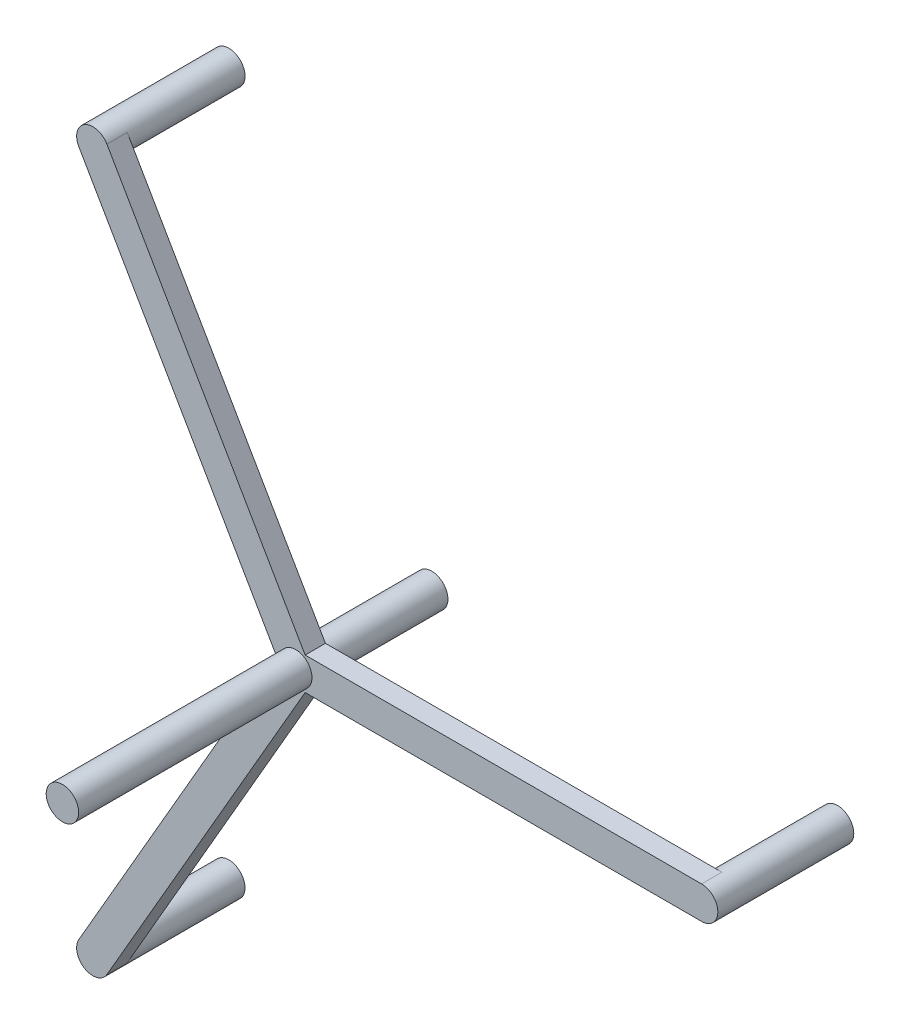
ISO-10303-21;
HEADER;
FILE_DESCRIPTION(('STEP AP214'),'2;1');
FILE_NAME('part.step','',(''),(''),'','','');
FILE_SCHEMA(('AUTOMOTIVE_DESIGN { 1 0 10303 214 1 1 1 1 }'));
ENDSEC;
DATA;
#1=APPLICATION_CONTEXT('core data for automotive mechanical design processes');
#2=APPLICATION_PROTOCOL_DEFINITION('international standard','automotive_design',2000,#1);
#3=PRODUCT_CONTEXT('',#1,'mechanical');
#4=PRODUCT('Part','Part','',(#3));
#5=PRODUCT_RELATED_PRODUCT_CATEGORY('part','',(#4));
#6=PRODUCT_DEFINITION_FORMATION('','',#4);
#7=PRODUCT_DEFINITION_CONTEXT('part definition',#1,'design');
#8=PRODUCT_DEFINITION('design','',#6,#7);
#9=PRODUCT_DEFINITION_SHAPE('','',#8);
#10=(LENGTH_UNIT() NAMED_UNIT(*) SI_UNIT(.MILLI.,.METRE.));
#11=(NAMED_UNIT(*) PLANE_ANGLE_UNIT() SI_UNIT($,.RADIAN.));
#12=(NAMED_UNIT(*) SI_UNIT($,.STERADIAN.) SOLID_ANGLE_UNIT());
#13=UNCERTAINTY_MEASURE_WITH_UNIT(LENGTH_MEASURE(1.E-05),#10,'distance_accuracy_value','');
#14=(GEOMETRIC_REPRESENTATION_CONTEXT(3) GLOBAL_UNCERTAINTY_ASSIGNED_CONTEXT((#13)) GLOBAL_UNIT_ASSIGNED_CONTEXT((#10,
#11,#12)) REPRESENTATION_CONTEXT('',''));
#15=CARTESIAN_POINT('',(0.,0.,0.));
#16=DIRECTION('',(0.,0.,1.));
#17=DIRECTION('',(1.,0.,0.));
#18=AXIS2_PLACEMENT_3D('',#15,#16,#17);
#19=CARTESIAN_POINT('',(0.,-2.,-1.25));
#20=DIRECTION('',(0.,-1.,0.));
#21=DIRECTION('',(0.,0.,-1.));
#22=AXIS2_PLACEMENT_3D('',#19,#20,#21);
#23=PLANE('',#22);
#24=DIRECTION('',(1.,0.,0.));
#25=VECTOR('',#24,1.);
#26=CARTESIAN_POINT('',(0.,-2.,1.25));
#27=LINE('',#26,#25);
#28=CARTESIAN_POINT('',(1.15470053837926,-2.,1.25));
#29=VERTEX_POINT('',#28);
#30=CARTESIAN_POINT('',(50.,-2.,1.25));
#31=VERTEX_POINT('',#30);
#32=EDGE_CURVE('E184',#29,#31,#27,.T.);
#33=ORIENTED_EDGE('',*,*,#32,.F.);
#34=DIRECTION('',(0.,0.,-1.));
#35=VECTOR('',#34,1.);
#36=CARTESIAN_POINT('',(1.15470053837926,-2.,-1.25));
#37=LINE('',#36,#35);
#38=CARTESIAN_POINT('',(1.15470053837926,-2.,-1.25));
#39=VERTEX_POINT('',#38);
#40=EDGE_CURVE('E50',#29,#39,#37,.T.);
#41=ORIENTED_EDGE('',*,*,#40,.T.);
#42=DIRECTION('',(1.,0.,0.));
#43=VECTOR('',#42,1.);
#44=CARTESIAN_POINT('',(0.,-2.,-1.25));
#45=LINE('',#44,#43);
#46=CARTESIAN_POINT('',(50.,-2.,-1.25));
#47=VERTEX_POINT('',#46);
#48=EDGE_CURVE('E191',#39,#47,#45,.T.);
#49=ORIENTED_EDGE('',*,*,#48,.T.);
#50=DIRECTION('',(0.,0.,1.));
#51=VECTOR('',#50,1.);
#52=CARTESIAN_POINT('',(50.,-2.,-1.25));
#53=LINE('',#52,#51);
#54=EDGE_CURVE('E197',#47,#31,#53,.T.);
#55=ORIENTED_EDGE('',*,*,#54,.T.);
#56=EDGE_LOOP('',(#33,#41,#49,#55));
#57=FACE_BOUND('',#56,.T.);
#58=ADVANCED_FACE('F36',(#57),#23,.T.);
#59=CARTESIAN_POINT('',(0.,0.,-15.5));
#60=DIRECTION('',(0.,0.,1.));
#61=DIRECTION('',(1.,0.,0.));
#62=AXIS2_PLACEMENT_3D('',#59,#60,#61);
#63=CYLINDRICAL_SURFACE('',#62,2.);
#64=CARTESIAN_POINT('',(0.,0.,-15.5));
#65=DIRECTION('',(0.,0.,1.));
#66=DIRECTION('',(1.,0.,0.));
#67=AXIS2_PLACEMENT_3D('',#64,#65,#66);
#68=CIRCLE('',#67,2.);
#69=CARTESIAN_POINT('',(2.,0.,-15.5));
#70=VERTEX_POINT('',#69);
#71=EDGE_CURVE('E175',#70,#70,#68,.T.);
#72=ORIENTED_EDGE('',*,*,#71,.T.);
#73=EDGE_LOOP('',(#72));
#74=FACE_BOUND('',#73,.T.);
#75=CARTESIAN_POINT('',(0.,0.,-1.25));
#76=DIRECTION('',(0.,0.,1.));
#77=DIRECTION('',(1.,0.,0.));
#78=AXIS2_PLACEMENT_3D('',#75,#76,#77);
#79=CIRCLE('',#78,2.);
#80=CARTESIAN_POINT('',(2.,0.,-1.25));
#81=VERTEX_POINT('',#80);
#82=EDGE_CURVE('E188',#81,#81,#79,.T.);
#83=ORIENTED_EDGE('',*,*,#82,.F.);
#84=EDGE_LOOP('',(#83));
#85=FACE_BOUND('',#84,.T.);
#86=ADVANCED_FACE('F235',(#74,#85),#63,.T.);
#87=CARTESIAN_POINT('',(0.,2.,-1.25));
#88=DIRECTION('',(0.,-1.,0.));
#89=DIRECTION('',(0.,0.,-1.));
#90=AXIS2_PLACEMENT_3D('',#87,#88,#89);
#91=PLANE('',#90);
#92=DIRECTION('',(1.,0.,0.));
#93=VECTOR('',#92,1.);
#94=CARTESIAN_POINT('',(0.,2.,-1.25));
#95=LINE('',#94,#93);
#96=CARTESIAN_POINT('',(1.15470053837925,2.,-1.25));
#97=VERTEX_POINT('',#96);
#98=CARTESIAN_POINT('',(50.,2.,-1.25));
#99=VERTEX_POINT('',#98);
#100=EDGE_CURVE('E58',#97,#99,#95,.T.);
#101=ORIENTED_EDGE('',*,*,#100,.F.);
#102=DIRECTION('',(0.,0.,1.));
#103=VECTOR('',#102,1.);
#104=CARTESIAN_POINT('',(1.15470053837925,2.,-1.25));
#105=LINE('',#104,#103);
#106=CARTESIAN_POINT('',(1.15470053837925,2.,1.25));
#107=VERTEX_POINT('',#106);
#108=EDGE_CURVE('E170',#97,#107,#105,.T.);
#109=ORIENTED_EDGE('',*,*,#108,.T.);
#110=DIRECTION('',(1.,0.,0.));
#111=VECTOR('',#110,1.);
#112=CARTESIAN_POINT('',(0.,2.,1.25));
#113=LINE('',#112,#111);
#114=CARTESIAN_POINT('',(50.,2.,1.25));
#115=VERTEX_POINT('',#114);
#116=EDGE_CURVE('E186',#107,#115,#113,.T.);
#117=ORIENTED_EDGE('',*,*,#116,.T.);
#118=DIRECTION('',(0.,0.,1.));
#119=VECTOR('',#118,1.);
#120=CARTESIAN_POINT('',(50.,2.,-1.25));
#121=LINE('',#120,#119);
#122=EDGE_CURVE('E43',#99,#115,#121,.T.);
#123=ORIENTED_EDGE('',*,*,#122,.F.);
#124=EDGE_LOOP('',(#101,#109,#117,#123));
#125=FACE_BOUND('',#124,.T.);
#126=ADVANCED_FACE('F214',(#125),#91,.F.);
#127=CARTESIAN_POINT('',(0.,0.,-1.25));
#128=DIRECTION('',(0.,0.,1.));
#129=DIRECTION('',(1.,0.,0.));
#130=AXIS2_PLACEMENT_3D('',#127,#128,#129);
#131=PLANE('',#130);
#132=DIRECTION('',(-0.500000000000004,0.866025403784436,0.));
#133=VECTOR('',#132,1.);
#134=CARTESIAN_POINT('',(1.73205080756887,1.00000000000001,-1.25));
#135=LINE('',#134,#133);
#136=CARTESIAN_POINT('',(-23.2679491924313,44.3012701892218,-1.25));
#137=VERTEX_POINT('',#136);
#138=EDGE_CURVE('E157',#97,#137,#135,.T.);
#139=ORIENTED_EDGE('',*,*,#138,.F.);
#140=ORIENTED_EDGE('',*,*,#100,.T.);
#141=CARTESIAN_POINT('',(50.,0.,-1.25));
#142=DIRECTION('',(0.,0.,1.));
#143=DIRECTION('',(1.,0.,0.));
#144=AXIS2_PLACEMENT_3D('',#141,#142,#143);
#145=CIRCLE('',#144,2.);
#146=EDGE_CURVE('E193',#99,#47,#145,.T.);
#147=ORIENTED_EDGE('',*,*,#146,.T.);
#148=ORIENTED_EDGE('',*,*,#48,.F.);
#149=DIRECTION('',(-0.499999999999992,-0.866025403784443,0.));
#150=VECTOR('',#149,1.);
#151=CARTESIAN_POINT('',(1.73205080756889,-0.999999999999984,-1.25));
#152=LINE('',#151,#150);
#153=CARTESIAN_POINT('',(-23.2679491924307,-44.3012701892222,-1.25));
#154=VERTEX_POINT('',#153);
#155=EDGE_CURVE('E118',#39,#154,#152,.T.);
#156=ORIENTED_EDGE('',*,*,#155,.T.);
#157=CARTESIAN_POINT('',(-24.9999999999996,-43.3012701892222,-1.25));
#158=DIRECTION('',(0.,0.,1.));
#159=DIRECTION('',(-0.499999999999992,-0.866025403784443,0.));
#160=AXIS2_PLACEMENT_3D('',#157,#158,#159);
#161=CIRCLE('',#160,2.);
#162=CARTESIAN_POINT('',(-26.7320508075685,-42.3012701892222,-1.25));
#163=VERTEX_POINT('',#162);
#164=EDGE_CURVE('E147',#154,#163,#161,.T.);
#165=ORIENTED_EDGE('',*,*,#164,.T.);
#166=DIRECTION('',(-0.499999999999992,-0.866025403784443,0.));
#167=VECTOR('',#166,1.);
#168=CARTESIAN_POINT('',(-1.73205080756889,0.999999999999984,-1.25));
#169=LINE('',#168,#167);
#170=CARTESIAN_POINT('',(-2.3094010767585,0.,-1.25));
#171=VERTEX_POINT('',#170);
#172=EDGE_CURVE('E112',#171,#163,#169,.T.);
#173=ORIENTED_EDGE('',*,*,#172,.F.);
#174=DIRECTION('',(-0.500000000000004,0.866025403784436,0.));
#175=VECTOR('',#174,1.);
#176=CARTESIAN_POINT('',(-1.73205080756887,-1.00000000000001,-1.25));
#177=LINE('',#176,#175);
#178=CARTESIAN_POINT('',(-26.7320508075691,42.3012701892218,-1.25));
#179=VERTEX_POINT('',#178);
#180=EDGE_CURVE('E162',#171,#179,#177,.T.);
#181=ORIENTED_EDGE('',*,*,#180,.T.);
#182=CARTESIAN_POINT('',(-25.0000000000002,43.3012701892218,-1.25));
#183=DIRECTION('',(0.,0.,1.));
#184=DIRECTION('',(-0.500000000000004,0.866025403784436,0.));
#185=AXIS2_PLACEMENT_3D('',#182,#183,#184);
#186=CIRCLE('',#185,2.);
#187=EDGE_CURVE('E159',#179,#137,#186,.T.);
#188=ORIENTED_EDGE('',*,*,#187,.T.);
#189=EDGE_LOOP('',(#139,#140,#147,#148,#156,#165,#173,#181,#188));
#190=FACE_BOUND('',#189,.T.);
#191=ORIENTED_EDGE('',*,*,#82,.T.);
#192=EDGE_LOOP('',(#191));
#193=FACE_BOUND('',#192,.T.);
#194=ADVANCED_FACE('F212',(#190,#193),#131,.F.);
#195=CARTESIAN_POINT('',(0.,0.,1.25));
#196=DIRECTION('',(0.,0.,1.));
#197=DIRECTION('',(1.,0.,0.));
#198=AXIS2_PLACEMENT_3D('',#195,#196,#197);
#199=PLANE('',#198);
#200=ORIENTED_EDGE('',*,*,#116,.F.);
#201=DIRECTION('',(-0.500000000000004,0.866025403784436,0.));
#202=VECTOR('',#201,1.);
#203=CARTESIAN_POINT('',(1.73205080756887,1.00000000000001,1.25));
#204=LINE('',#203,#202);
#205=CARTESIAN_POINT('',(-23.2679491924313,44.3012701892218,1.25));
#206=VERTEX_POINT('',#205);
#207=EDGE_CURVE('E153',#107,#206,#204,.T.);
#208=ORIENTED_EDGE('',*,*,#207,.T.);
#209=CARTESIAN_POINT('',(-25.0000000000002,43.3012701892218,1.25));
#210=DIRECTION('',(0.,0.,1.));
#211=DIRECTION('',(-0.500000000000004,0.866025403784436,0.));
#212=AXIS2_PLACEMENT_3D('',#209,#210,#211);
#213=CIRCLE('',#212,2.);
#214=CARTESIAN_POINT('',(-26.7320508075691,42.3012701892218,1.25));
#215=VERTEX_POINT('',#214);
#216=EDGE_CURVE('E139',#206,#215,#213,.T.);
#217=ORIENTED_EDGE('',*,*,#216,.T.);
#218=DIRECTION('',(-0.500000000000004,0.866025403784436,0.));
#219=VECTOR('',#218,1.);
#220=CARTESIAN_POINT('',(-1.73205080756887,-1.00000000000001,1.25));
#221=LINE('',#220,#219);
#222=CARTESIAN_POINT('',(-2.3094010767585,0.,1.25));
#223=VERTEX_POINT('',#222);
#224=EDGE_CURVE('E128',#223,#215,#221,.T.);
#225=ORIENTED_EDGE('',*,*,#224,.F.);
#226=DIRECTION('',(-0.499999999999992,-0.866025403784443,0.));
#227=VECTOR('',#226,1.);
#228=CARTESIAN_POINT('',(-1.73205080756889,0.999999999999984,1.25));
#229=LINE('',#228,#227);
#230=CARTESIAN_POINT('',(-26.7320508075685,-42.3012701892222,1.25));
#231=VERTEX_POINT('',#230);
#232=EDGE_CURVE('E110',#223,#231,#229,.T.);
#233=ORIENTED_EDGE('',*,*,#232,.T.);
#234=CARTESIAN_POINT('',(-24.9999999999996,-43.3012701892222,1.25));
#235=DIRECTION('',(0.,0.,1.));
#236=DIRECTION('',(-0.499999999999992,-0.866025403784443,0.));
#237=AXIS2_PLACEMENT_3D('',#234,#235,#236);
#238=CIRCLE('',#237,2.);
#239=CARTESIAN_POINT('',(-23.2679491924307,-44.3012701892222,1.25));
#240=VERTEX_POINT('',#239);
#241=EDGE_CURVE('E126',#231,#240,#238,.T.);
#242=ORIENTED_EDGE('',*,*,#241,.T.);
#243=DIRECTION('',(-0.499999999999992,-0.866025403784443,0.));
#244=VECTOR('',#243,1.);
#245=CARTESIAN_POINT('',(1.73205080756889,-0.999999999999984,1.25));
#246=LINE('',#245,#244);
#247=EDGE_CURVE('E130',#29,#240,#246,.T.);
#248=ORIENTED_EDGE('',*,*,#247,.F.);
#249=ORIENTED_EDGE('',*,*,#32,.T.);
#250=CARTESIAN_POINT('',(50.,0.,1.25));
#251=DIRECTION('',(0.,0.,1.));
#252=DIRECTION('',(1.,0.,0.));
#253=AXIS2_PLACEMENT_3D('',#250,#251,#252);
#254=CIRCLE('',#253,2.);
#255=EDGE_CURVE('E178',#31,#115,#254,.T.);
#256=ORIENTED_EDGE('',*,*,#255,.T.);
#257=EDGE_LOOP('',(#200,#208,#217,#225,#233,#242,#248,#249,#256));
#258=FACE_BOUND('',#257,.T.);
#259=CARTESIAN_POINT('',(0.,0.,1.25));
#260=DIRECTION('',(0.,0.,1.));
#261=DIRECTION('',(1.,0.,0.));
#262=AXIS2_PLACEMENT_3D('',#259,#260,#261);
#263=CIRCLE('',#262,2.);
#264=CARTESIAN_POINT('',(2.,0.,1.25));
#265=VERTEX_POINT('',#264);
#266=EDGE_CURVE('E11',#265,#265,#263,.F.);
#267=ORIENTED_EDGE('',*,*,#266,.T.);
#268=EDGE_LOOP('',(#267));
#269=FACE_BOUND('',#268,.T.);
#270=ADVANCED_FACE('F123',(#258,#269),#199,.T.);
#271=CARTESIAN_POINT('',(50.,0.,-15.5));
#272=DIRECTION('',(0.,0.,1.));
#273=DIRECTION('',(1.,0.,0.));
#274=AXIS2_PLACEMENT_3D('',#271,#272,#273);
#275=CYLINDRICAL_SURFACE('',#274,2.);
#276=ORIENTED_EDGE('',*,*,#146,.F.);
#277=ORIENTED_EDGE('',*,*,#122,.T.);
#278=ORIENTED_EDGE('',*,*,#255,.F.);
#279=ORIENTED_EDGE('',*,*,#54,.F.);
#280=EDGE_LOOP('',(#276,#277,#278,#279));
#281=FACE_BOUND('',#280,.T.);
#282=CARTESIAN_POINT('',(50.,0.,-15.5));
#283=DIRECTION('',(0.,0.,1.));
#284=DIRECTION('',(1.,0.,0.));
#285=AXIS2_PLACEMENT_3D('',#282,#283,#284);
#286=CIRCLE('',#285,2.);
#287=CARTESIAN_POINT('',(52.,0.,-15.5));
#288=VERTEX_POINT('',#287);
#289=EDGE_CURVE('E181',#288,#288,#286,.T.);
#290=ORIENTED_EDGE('',*,*,#289,.T.);
#291=EDGE_LOOP('',(#290));
#292=FACE_BOUND('',#291,.T.);
#293=ADVANCED_FACE('F204',(#281,#292),#275,.T.);
#294=CARTESIAN_POINT('',(0.,0.,-15.5));
#295=DIRECTION('',(0.,0.,1.));
#296=DIRECTION('',(1.,0.,0.));
#297=AXIS2_PLACEMENT_3D('',#294,#295,#296);
#298=PLANE('',#297);
#299=ORIENTED_EDGE('',*,*,#289,.F.);
#300=EDGE_LOOP('',(#299));
#301=FACE_BOUND('',#300,.T.);
#302=ADVANCED_FACE('F250',(#301),#298,.F.);
#303=ORIENTED_EDGE('',*,*,#266,.F.);
#304=EDGE_LOOP('',(#303));
#305=FACE_BOUND('',#304,.T.);
#306=CARTESIAN_POINT('',(0.,0.,30.));
#307=DIRECTION('',(0.,0.,1.));
#308=DIRECTION('',(1.,0.,0.));
#309=AXIS2_PLACEMENT_3D('',#306,#307,#308);
#310=CIRCLE('',#309,2.);
#311=CARTESIAN_POINT('',(2.,0.,30.));
#312=VERTEX_POINT('',#311);
#313=EDGE_CURVE('E172',#312,#312,#310,.T.);
#314=ORIENTED_EDGE('',*,*,#313,.F.);
#315=EDGE_LOOP('',(#314));
#316=FACE_BOUND('',#315,.T.);
#317=ADVANCED_FACE('F241',(#305,#316),#63,.T.);
#318=CARTESIAN_POINT('',(0.,0.,-15.5));
#319=DIRECTION('',(0.,0.,1.));
#320=DIRECTION('',(1.,0.,0.));
#321=AXIS2_PLACEMENT_3D('',#318,#319,#320);
#322=PLANE('',#321);
#323=ORIENTED_EDGE('',*,*,#71,.F.);
#324=EDGE_LOOP('',(#323));
#325=FACE_BOUND('',#324,.T.);
#326=ADVANCED_FACE('F249',(#325),#322,.F.);
#327=CARTESIAN_POINT('',(0.,0.,30.));
#328=DIRECTION('',(0.,0.,1.));
#329=DIRECTION('',(1.,0.,0.));
#330=AXIS2_PLACEMENT_3D('',#327,#328,#329);
#331=PLANE('',#330);
#332=ORIENTED_EDGE('',*,*,#313,.T.);
#333=EDGE_LOOP('',(#332));
#334=FACE_BOUND('',#333,.T.);
#335=ADVANCED_FACE('F232',(#334),#331,.T.);
#336=CARTESIAN_POINT('',(1.73205080756887,1.00000000000001,-1.25));
#337=DIRECTION('',(0.866025403784436,0.500000000000004,0.));
#338=DIRECTION('',(-0.500000000000004,0.866025403784436,0.));
#339=AXIS2_PLACEMENT_3D('',#336,#337,#338);
#340=PLANE('',#339);
#341=ORIENTED_EDGE('',*,*,#108,.F.);
#342=ORIENTED_EDGE('',*,*,#138,.T.);
#343=DIRECTION('',(0.,0.,1.));
#344=VECTOR('',#343,1.);
#345=CARTESIAN_POINT('',(-23.2679491924313,44.3012701892218,-1.25));
#346=LINE('',#345,#344);
#347=EDGE_CURVE('E164',#137,#206,#346,.T.);
#348=ORIENTED_EDGE('',*,*,#347,.T.);
#349=ORIENTED_EDGE('',*,*,#207,.F.);
#350=EDGE_LOOP('',(#341,#342,#348,#349));
#351=FACE_BOUND('',#350,.T.);
#352=ADVANCED_FACE('F216',(#351),#340,.T.);
#353=CARTESIAN_POINT('',(-1.73205080756887,-1.00000000000001,-1.25));
#354=DIRECTION('',(0.866025403784436,0.500000000000004,0.));
#355=DIRECTION('',(-0.500000000000004,0.866025403784436,0.));
#356=AXIS2_PLACEMENT_3D('',#353,#354,#355);
#357=PLANE('',#356);
#358=ORIENTED_EDGE('',*,*,#180,.F.);
#359=DIRECTION('',(0.,0.,1.));
#360=VECTOR('',#359,1.);
#361=CARTESIAN_POINT('',(-2.3094010767585,0.,-1.25));
#362=LINE('',#361,#360);
#363=EDGE_CURVE('E150',#171,#223,#362,.T.);
#364=ORIENTED_EDGE('',*,*,#363,.T.);
#365=ORIENTED_EDGE('',*,*,#224,.T.);
#366=DIRECTION('',(0.,0.,1.));
#367=VECTOR('',#366,1.);
#368=CARTESIAN_POINT('',(-26.7320508075691,42.3012701892218,-1.25));
#369=LINE('',#368,#367);
#370=EDGE_CURVE('E165',#179,#215,#369,.T.);
#371=ORIENTED_EDGE('',*,*,#370,.F.);
#372=EDGE_LOOP('',(#358,#364,#365,#371));
#373=FACE_BOUND('',#372,.T.);
#374=ADVANCED_FACE('F224',(#373),#357,.F.);
#375=CARTESIAN_POINT('',(-1.73205080756889,0.999999999999984,-1.25));
#376=DIRECTION('',(-0.866025403784443,0.499999999999992,0.));
#377=DIRECTION('',(-0.499999999999992,-0.866025403784443,0.));
#378=AXIS2_PLACEMENT_3D('',#375,#376,#377);
#379=PLANE('',#378);
#380=ORIENTED_EDGE('',*,*,#363,.F.);
#381=ORIENTED_EDGE('',*,*,#172,.T.);
#382=DIRECTION('',(0.,0.,1.));
#383=VECTOR('',#382,1.);
#384=CARTESIAN_POINT('',(-26.7320508075685,-42.3012701892222,-1.25));
#385=LINE('',#384,#383);
#386=EDGE_CURVE('E106',#163,#231,#385,.T.);
#387=ORIENTED_EDGE('',*,*,#386,.T.);
#388=ORIENTED_EDGE('',*,*,#232,.F.);
#389=EDGE_LOOP('',(#380,#381,#387,#388));
#390=FACE_BOUND('',#389,.T.);
#391=ADVANCED_FACE('F109',(#390),#379,.T.);
#392=CARTESIAN_POINT('',(1.73205080756889,-0.999999999999984,-1.25));
#393=DIRECTION('',(-0.866025403784443,0.499999999999992,0.));
#394=DIRECTION('',(-0.499999999999992,-0.866025403784443,0.));
#395=AXIS2_PLACEMENT_3D('',#392,#393,#394);
#396=PLANE('',#395);
#397=ORIENTED_EDGE('',*,*,#40,.F.);
#398=ORIENTED_EDGE('',*,*,#247,.T.);
#399=DIRECTION('',(0.,0.,1.));
#400=VECTOR('',#399,1.);
#401=CARTESIAN_POINT('',(-23.2679491924307,-44.3012701892222,-1.25));
#402=LINE('',#401,#400);
#403=EDGE_CURVE('E117',#154,#240,#402,.T.);
#404=ORIENTED_EDGE('',*,*,#403,.F.);
#405=ORIENTED_EDGE('',*,*,#155,.F.);
#406=EDGE_LOOP('',(#397,#398,#404,#405));
#407=FACE_BOUND('',#406,.T.);
#408=ADVANCED_FACE('F208',(#407),#396,.F.);
#409=CARTESIAN_POINT('',(-25.0000000000002,43.3012701892218,-15.5));
#410=DIRECTION('',(0.,0.,1.));
#411=DIRECTION('',(1.,0.,0.));
#412=AXIS2_PLACEMENT_3D('',#409,#410,#411);
#413=CYLINDRICAL_SURFACE('',#412,2.);
#414=CARTESIAN_POINT('',(-25.0000000000002,43.3012701892218,-15.5));
#415=DIRECTION('',(0.,0.,1.));
#416=DIRECTION('',(-0.500000000000004,0.866025403784436,0.));
#417=AXIS2_PLACEMENT_3D('',#414,#415,#416);
#418=CIRCLE('',#417,2.);
#419=CARTESIAN_POINT('',(-26.0000000000002,45.0333209967907,-15.5));
#420=VERTEX_POINT('',#419);
#421=EDGE_CURVE('E131',#420,#420,#418,.T.);
#422=ORIENTED_EDGE('',*,*,#421,.T.);
#423=EDGE_LOOP('',(#422));
#424=FACE_BOUND('',#423,.T.);
#425=ORIENTED_EDGE('',*,*,#347,.F.);
#426=ORIENTED_EDGE('',*,*,#187,.F.);
#427=ORIENTED_EDGE('',*,*,#370,.T.);
#428=ORIENTED_EDGE('',*,*,#216,.F.);
#429=EDGE_LOOP('',(#425,#426,#427,#428));
#430=FACE_BOUND('',#429,.T.);
#431=ADVANCED_FACE('F220',(#424,#430),#413,.T.);
#432=CARTESIAN_POINT('',(0.,0.,-15.5));
#433=DIRECTION('',(0.,0.,1.));
#434=DIRECTION('',(-0.500000000000004,0.866025403784436,0.));
#435=AXIS2_PLACEMENT_3D('',#432,#433,#434);
#436=PLANE('',#435);
#437=ORIENTED_EDGE('',*,*,#421,.F.);
#438=EDGE_LOOP('',(#437));
#439=FACE_BOUND('',#438,.T.);
#440=ADVANCED_FACE('F299',(#439),#436,.F.);
#441=CARTESIAN_POINT('',(-24.9999999999996,-43.3012701892222,-15.5));
#442=DIRECTION('',(0.,0.,1.));
#443=DIRECTION('',(1.,0.,0.));
#444=AXIS2_PLACEMENT_3D('',#441,#442,#443);
#445=CYLINDRICAL_SURFACE('',#444,2.);
#446=CARTESIAN_POINT('',(-24.9999999999996,-43.3012701892222,-15.5));
#447=DIRECTION('',(0.,0.,1.));
#448=DIRECTION('',(-0.499999999999992,-0.866025403784443,0.));
#449=AXIS2_PLACEMENT_3D('',#446,#447,#448);
#450=CIRCLE('',#449,2.);
#451=CARTESIAN_POINT('',(-25.9999999999996,-45.0333209967911,-15.5));
#452=VERTEX_POINT('',#451);
#453=EDGE_CURVE('E136',#452,#452,#450,.T.);
#454=ORIENTED_EDGE('',*,*,#453,.T.);
#455=EDGE_LOOP('',(#454));
#456=FACE_BOUND('',#455,.T.);
#457=ORIENTED_EDGE('',*,*,#386,.F.);
#458=ORIENTED_EDGE('',*,*,#164,.F.);
#459=ORIENTED_EDGE('',*,*,#403,.T.);
#460=ORIENTED_EDGE('',*,*,#241,.F.);
#461=EDGE_LOOP('',(#457,#458,#459,#460));
#462=FACE_BOUND('',#461,.T.);
#463=ADVANCED_FACE('F134',(#456,#462),#445,.T.);
#464=CARTESIAN_POINT('',(0.,0.,-15.5));
#465=DIRECTION('',(0.,0.,1.));
#466=DIRECTION('',(-0.499999999999992,-0.866025403784443,0.));
#467=AXIS2_PLACEMENT_3D('',#464,#465,#466);
#468=PLANE('',#467);
#469=ORIENTED_EDGE('',*,*,#453,.F.);
#470=EDGE_LOOP('',(#469));
#471=FACE_BOUND('',#470,.T.);
#472=ADVANCED_FACE('F287',(#471),#468,.F.);
#473=CLOSED_SHELL('',(#58,#86,#126,#194,#270,#293,#302,#317,#326,#335,#352,#374,#391,#408,#431,
#440,#463,#472));
#474=MANIFOLD_SOLID_BREP('B2',#473);
#475=ADVANCED_BREP_SHAPE_REPRESENTATION('',(#18,#474),#14);
#476=SHAPE_DEFINITION_REPRESENTATION(#9,#475);
ENDSEC;
END-ISO-10303-21;
